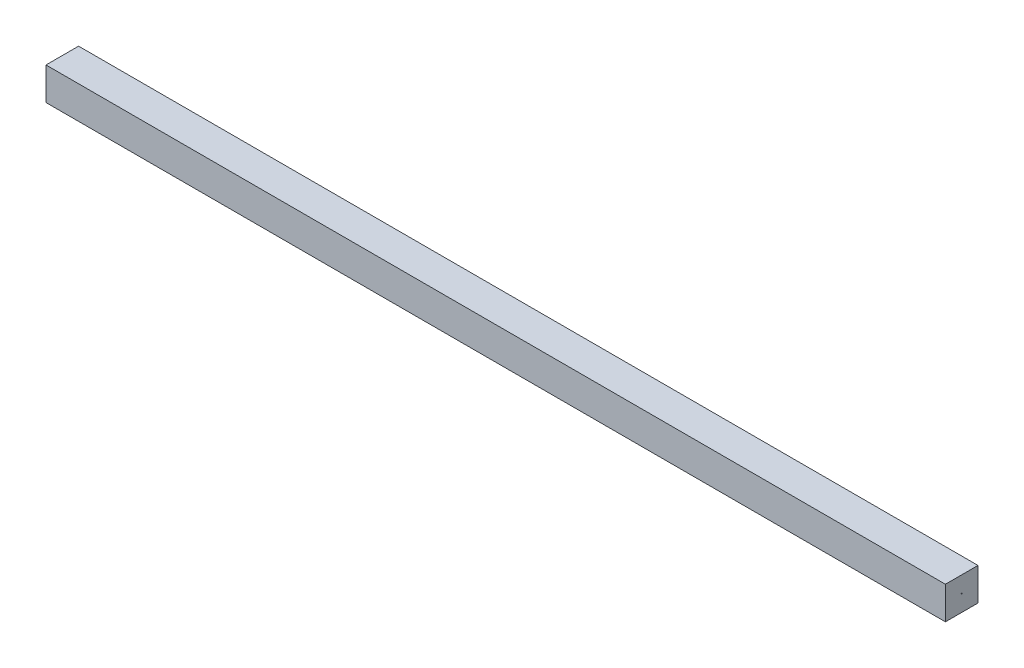
ISO-10303-21;
HEADER;
FILE_DESCRIPTION(('STEP AP214'),'2;1');
FILE_NAME('part.step','',(''),(''),'','','');
FILE_SCHEMA(('AUTOMOTIVE_DESIGN { 1 0 10303 214 1 1 1 1 }'));
ENDSEC;
DATA;
#1=APPLICATION_CONTEXT('core data for automotive mechanical design processes');
#2=APPLICATION_PROTOCOL_DEFINITION('international standard','automotive_design',2000,#1);
#3=PRODUCT_CONTEXT('',#1,'mechanical');
#4=PRODUCT('Part','Part','',(#3));
#5=PRODUCT_RELATED_PRODUCT_CATEGORY('part','',(#4));
#6=PRODUCT_DEFINITION_FORMATION('','',#4);
#7=PRODUCT_DEFINITION_CONTEXT('part definition',#1,'design');
#8=PRODUCT_DEFINITION('design','',#6,#7);
#9=PRODUCT_DEFINITION_SHAPE('','',#8);
#10=(LENGTH_UNIT() NAMED_UNIT(*) SI_UNIT(.MILLI.,.METRE.));
#11=(NAMED_UNIT(*) PLANE_ANGLE_UNIT() SI_UNIT($,.RADIAN.));
#12=(NAMED_UNIT(*) SI_UNIT($,.STERADIAN.) SOLID_ANGLE_UNIT());
#13=UNCERTAINTY_MEASURE_WITH_UNIT(LENGTH_MEASURE(1.E-05),#10,'distance_accuracy_value','');
#14=(GEOMETRIC_REPRESENTATION_CONTEXT(3) GLOBAL_UNCERTAINTY_ASSIGNED_CONTEXT((#13)) GLOBAL_UNIT_ASSIGNED_CONTEXT((#10,
#11,#12)) REPRESENTATION_CONTEXT('',''));
#15=CARTESIAN_POINT('',(0.,0.,0.));
#16=DIRECTION('',(0.,0.,1.));
#17=DIRECTION('',(1.,0.,0.));
#18=AXIS2_PLACEMENT_3D('',#15,#16,#17);
#19=CARTESIAN_POINT('',(414.,0.,0.));
#20=DIRECTION('',(1.,0.,0.));
#21=DIRECTION('',(0.,0.,-1.));
#22=AXIS2_PLACEMENT_3D('',#19,#20,#21);
#23=PLANE('',#22);
#24=DIRECTION('',(0.,-1.,0.));
#25=VECTOR('',#24,1.);
#26=CARTESIAN_POINT('',(414.,30.,0.));
#27=LINE('',#26,#25);
#28=CARTESIAN_POINT('',(414.,30.,0.));
#29=VERTEX_POINT('',#28);
#30=CARTESIAN_POINT('',(414.,0.,0.));
#31=VERTEX_POINT('',#30);
#32=EDGE_CURVE('E86',#29,#31,#27,.T.);
#33=ORIENTED_EDGE('',*,*,#32,.T.);
#34=DIRECTION('',(0.,0.,-1.));
#35=VECTOR('',#34,1.);
#36=CARTESIAN_POINT('',(414.,0.,0.));
#37=LINE('',#36,#35);
#38=CARTESIAN_POINT('',(414.,0.,-30.));
#39=VERTEX_POINT('',#38);
#40=EDGE_CURVE('E81',#31,#39,#37,.T.);
#41=ORIENTED_EDGE('',*,*,#40,.T.);
#42=DIRECTION('',(0.,1.,0.));
#43=VECTOR('',#42,1.);
#44=CARTESIAN_POINT('',(414.,0.,-30.));
#45=LINE('',#44,#43);
#46=CARTESIAN_POINT('',(414.,30.,-30.));
#47=VERTEX_POINT('',#46);
#48=EDGE_CURVE('E84',#39,#47,#45,.T.);
#49=ORIENTED_EDGE('',*,*,#48,.T.);
#50=DIRECTION('',(0.,0.,1.));
#51=VECTOR('',#50,1.);
#52=CARTESIAN_POINT('',(414.,30.,-30.));
#53=LINE('',#52,#51);
#54=EDGE_CURVE('E50',#47,#29,#53,.T.);
#55=ORIENTED_EDGE('',*,*,#54,.T.);
#56=EDGE_LOOP('',(#33,#41,#49,#55));
#57=FACE_BOUND('',#56,.T.);
#58=CARTESIAN_POINT('',(414.,15.,-15.));
#59=DIRECTION('',(1.,0.,0.));
#60=DIRECTION('',(0.,0.,-1.));
#61=AXIS2_PLACEMENT_3D('',#58,#59,#60);
#62=CIRCLE('',#61,0.500000000000001);
#63=CARTESIAN_POINT('',(414.,15.,-15.5));
#64=VERTEX_POINT('',#63);
#65=EDGE_CURVE('E36',#64,#64,#62,.F.);
#66=ORIENTED_EDGE('',*,*,#65,.T.);
#67=EDGE_LOOP('',(#66));
#68=FACE_BOUND('',#67,.T.);
#69=ADVANCED_FACE('F32',(#57,#68),#23,.T.);
#70=CARTESIAN_POINT('',(-414.,0.,0.));
#71=DIRECTION('',(1.,0.,0.));
#72=DIRECTION('',(0.,0.,-1.));
#73=AXIS2_PLACEMENT_3D('',#70,#71,#72);
#74=PLANE('',#73);
#75=DIRECTION('',(0.,-1.,0.));
#76=VECTOR('',#75,1.);
#77=CARTESIAN_POINT('',(-414.,30.,0.));
#78=LINE('',#77,#76);
#79=CARTESIAN_POINT('',(-414.,30.,0.));
#80=VERTEX_POINT('',#79);
#81=CARTESIAN_POINT('',(-414.,0.,0.));
#82=VERTEX_POINT('',#81);
#83=EDGE_CURVE('E100',#80,#82,#78,.T.);
#84=ORIENTED_EDGE('',*,*,#83,.F.);
#85=DIRECTION('',(0.,0.,1.));
#86=VECTOR('',#85,1.);
#87=CARTESIAN_POINT('',(-414.,30.,-30.));
#88=LINE('',#87,#86);
#89=CARTESIAN_POINT('',(-414.,30.,-30.));
#90=VERTEX_POINT('',#89);
#91=EDGE_CURVE('E73',#90,#80,#88,.T.);
#92=ORIENTED_EDGE('',*,*,#91,.F.);
#93=DIRECTION('',(0.,1.,0.));
#94=VECTOR('',#93,1.);
#95=CARTESIAN_POINT('',(-414.,0.,-30.));
#96=LINE('',#95,#94);
#97=CARTESIAN_POINT('',(-414.,0.,-30.));
#98=VERTEX_POINT('',#97);
#99=EDGE_CURVE('E67',#98,#90,#96,.T.);
#100=ORIENTED_EDGE('',*,*,#99,.F.);
#101=DIRECTION('',(0.,0.,-1.));
#102=VECTOR('',#101,1.);
#103=CARTESIAN_POINT('',(-414.,0.,0.));
#104=LINE('',#103,#102);
#105=EDGE_CURVE('E91',#82,#98,#104,.T.);
#106=ORIENTED_EDGE('',*,*,#105,.F.);
#107=EDGE_LOOP('',(#84,#92,#100,#106));
#108=FACE_BOUND('',#107,.T.);
#109=CARTESIAN_POINT('',(-414.,15.,-15.));
#110=DIRECTION('',(1.,0.,0.));
#111=DIRECTION('',(0.,0.,-1.));
#112=AXIS2_PLACEMENT_3D('',#109,#110,#111);
#113=CIRCLE('',#112,0.500000000000001);
#114=CARTESIAN_POINT('',(-414.,15.,-15.5));
#115=VERTEX_POINT('',#114);
#116=EDGE_CURVE('E11',#115,#115,#113,.F.);
#117=ORIENTED_EDGE('',*,*,#116,.F.);
#118=EDGE_LOOP('',(#117));
#119=FACE_BOUND('',#118,.T.);
#120=ADVANCED_FACE('F112',(#108,#119),#74,.F.);
#121=CARTESIAN_POINT('',(414.,30.,0.));
#122=DIRECTION('',(0.,0.,-1.));
#123=DIRECTION('',(0.,1.,0.));
#124=AXIS2_PLACEMENT_3D('',#121,#122,#123);
#125=PLANE('',#124);
#126=ORIENTED_EDGE('',*,*,#83,.T.);
#127=DIRECTION('',(-1.,0.,0.));
#128=VECTOR('',#127,1.);
#129=CARTESIAN_POINT('',(414.,0.,0.));
#130=LINE('',#129,#128);
#131=EDGE_CURVE('E42',#31,#82,#130,.T.);
#132=ORIENTED_EDGE('',*,*,#131,.F.);
#133=ORIENTED_EDGE('',*,*,#32,.F.);
#134=DIRECTION('',(-1.,0.,0.));
#135=VECTOR('',#134,1.);
#136=CARTESIAN_POINT('',(414.,30.,0.));
#137=LINE('',#136,#135);
#138=EDGE_CURVE('E96',#29,#80,#137,.T.);
#139=ORIENTED_EDGE('',*,*,#138,.T.);
#140=EDGE_LOOP('',(#126,#132,#133,#139));
#141=FACE_BOUND('',#140,.T.);
#142=ADVANCED_FACE('F34',(#141),#125,.F.);
#143=CARTESIAN_POINT('',(414.,0.,0.));
#144=DIRECTION('',(0.,1.,0.));
#145=DIRECTION('',(0.,0.,1.));
#146=AXIS2_PLACEMENT_3D('',#143,#144,#145);
#147=PLANE('',#146);
#148=ORIENTED_EDGE('',*,*,#105,.T.);
#149=DIRECTION('',(-1.,0.,0.));
#150=VECTOR('',#149,1.);
#151=CARTESIAN_POINT('',(414.,0.,-30.));
#152=LINE('',#151,#150);
#153=EDGE_CURVE('E89',#39,#98,#152,.T.);
#154=ORIENTED_EDGE('',*,*,#153,.F.);
#155=ORIENTED_EDGE('',*,*,#40,.F.);
#156=ORIENTED_EDGE('',*,*,#131,.T.);
#157=EDGE_LOOP('',(#148,#154,#155,#156));
#158=FACE_BOUND('',#157,.T.);
#159=ADVANCED_FACE('F90',(#158),#147,.F.);
#160=CARTESIAN_POINT('',(414.,0.,-30.));
#161=DIRECTION('',(0.,0.,1.));
#162=DIRECTION('',(1.,0.,0.));
#163=AXIS2_PLACEMENT_3D('',#160,#161,#162);
#164=PLANE('',#163);
#165=ORIENTED_EDGE('',*,*,#99,.T.);
#166=DIRECTION('',(-1.,0.,0.));
#167=VECTOR('',#166,1.);
#168=CARTESIAN_POINT('',(414.,30.,-30.));
#169=LINE('',#168,#167);
#170=EDGE_CURVE('E92',#47,#90,#169,.T.);
#171=ORIENTED_EDGE('',*,*,#170,.F.);
#172=ORIENTED_EDGE('',*,*,#48,.F.);
#173=ORIENTED_EDGE('',*,*,#153,.T.);
#174=EDGE_LOOP('',(#165,#171,#172,#173));
#175=FACE_BOUND('',#174,.T.);
#176=ADVANCED_FACE('F94',(#175),#164,.F.);
#177=CARTESIAN_POINT('',(414.,30.,-30.));
#178=DIRECTION('',(0.,-1.,0.));
#179=DIRECTION('',(0.,0.,-1.));
#180=AXIS2_PLACEMENT_3D('',#177,#178,#179);
#181=PLANE('',#180);
#182=ORIENTED_EDGE('',*,*,#91,.T.);
#183=ORIENTED_EDGE('',*,*,#138,.F.);
#184=ORIENTED_EDGE('',*,*,#54,.F.);
#185=ORIENTED_EDGE('',*,*,#170,.T.);
#186=EDGE_LOOP('',(#182,#183,#184,#185));
#187=FACE_BOUND('',#186,.T.);
#188=ADVANCED_FACE('F121',(#187),#181,.F.);
#189=CARTESIAN_POINT('',(-414.25,15.,-15.));
#190=DIRECTION('',(1.,0.,0.));
#191=DIRECTION('',(0.,0.,-1.));
#192=AXIS2_PLACEMENT_3D('',#189,#190,#191);
#193=CYLINDRICAL_SURFACE('',#192,0.500000000000001);
#194=CARTESIAN_POINT('',(-414.25,15.,-15.));
#195=DIRECTION('',(-1.,0.,0.));
#196=DIRECTION('',(0.,0.,1.));
#197=AXIS2_PLACEMENT_3D('',#194,#195,#196);
#198=CIRCLE('',#197,0.500000000000001);
#199=CARTESIAN_POINT('',(-414.25,15.,-14.5));
#200=VERTEX_POINT('',#199);
#201=EDGE_CURVE('E103',#200,#200,#198,.T.);
#202=ORIENTED_EDGE('',*,*,#201,.F.);
#203=EDGE_LOOP('',(#202));
#204=FACE_BOUND('',#203,.T.);
#205=ORIENTED_EDGE('',*,*,#116,.T.);
#206=EDGE_LOOP('',(#205));
#207=FACE_BOUND('',#206,.T.);
#208=ADVANCED_FACE('F118',(#204,#207),#193,.T.);
#209=CARTESIAN_POINT('',(-414.25,15.,-15.));
#210=DIRECTION('',(-1.,0.,0.));
#211=DIRECTION('',(0.,0.,1.));
#212=AXIS2_PLACEMENT_3D('',#209,#210,#211);
#213=PLANE('',#212);
#214=ORIENTED_EDGE('',*,*,#201,.T.);
#215=EDGE_LOOP('',(#214));
#216=FACE_BOUND('',#215,.T.);
#217=ADVANCED_FACE('F120',(#216),#213,.T.);
#218=CARTESIAN_POINT('',(414.25,15.,-15.));
#219=DIRECTION('',(-1.,0.,0.));
#220=DIRECTION('',(0.,0.,1.));
#221=AXIS2_PLACEMENT_3D('',#218,#219,#220);
#222=CYLINDRICAL_SURFACE('',#221,0.500000000000001);
#223=ORIENTED_EDGE('',*,*,#65,.F.);
#224=EDGE_LOOP('',(#223));
#225=FACE_BOUND('',#224,.T.);
#226=CARTESIAN_POINT('',(414.25,15.,-15.));
#227=DIRECTION('',(1.,0.,0.));
#228=DIRECTION('',(0.,0.,-1.));
#229=AXIS2_PLACEMENT_3D('',#226,#227,#228);
#230=CIRCLE('',#229,0.500000000000001);
#231=CARTESIAN_POINT('',(414.25,15.,-15.5));
#232=VERTEX_POINT('',#231);
#233=EDGE_CURVE('E192',#232,#232,#230,.T.);
#234=ORIENTED_EDGE('',*,*,#233,.F.);
#235=EDGE_LOOP('',(#234));
#236=FACE_BOUND('',#235,.T.);
#237=ADVANCED_FACE('F128',(#225,#236),#222,.T.);
#238=CARTESIAN_POINT('',(414.25,15.,-15.));
#239=DIRECTION('',(1.,0.,0.));
#240=DIRECTION('',(0.,0.,-1.));
#241=AXIS2_PLACEMENT_3D('',#238,#239,#240);
#242=PLANE('',#241);
#243=ORIENTED_EDGE('',*,*,#233,.T.);
#244=EDGE_LOOP('',(#243));
#245=FACE_BOUND('',#244,.T.);
#246=ADVANCED_FACE('F176',(#245),#242,.T.);
#247=CLOSED_SHELL('',(#69,#120,#142,#159,#176,#188,#208,#217,#237,#246));
#248=MANIFOLD_SOLID_BREP('B2',#247);
#249=ADVANCED_BREP_SHAPE_REPRESENTATION('',(#18,#248),#14);
#250=SHAPE_DEFINITION_REPRESENTATION(#9,#249);
ENDSEC;
END-ISO-10303-21;
